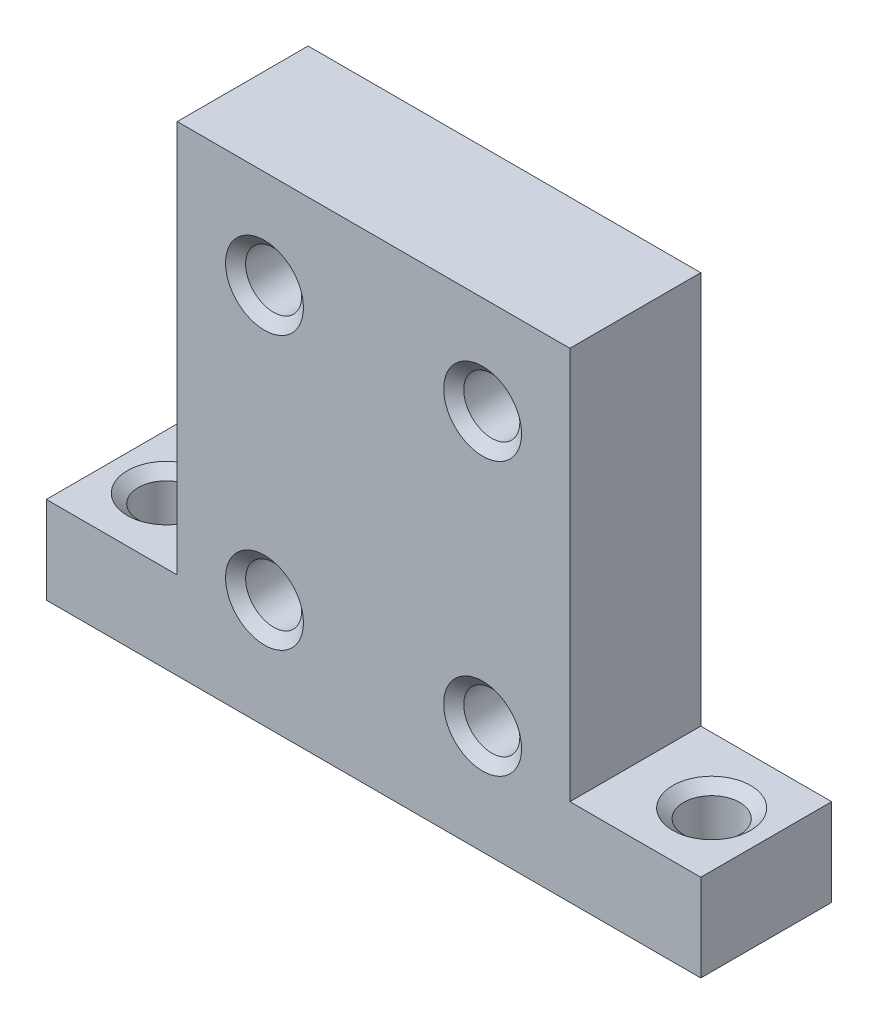
ISO-10303-21;
HEADER;
FILE_DESCRIPTION(('STEP AP214'),'2;1');
FILE_NAME('part.step','',(''),(''),'','','');
FILE_SCHEMA(('AUTOMOTIVE_DESIGN { 1 0 10303 214 1 1 1 1 }'));
ENDSEC;
DATA;
#1=APPLICATION_CONTEXT('core data for automotive mechanical design processes');
#2=APPLICATION_PROTOCOL_DEFINITION('international standard','automotive_design',2000,#1);
#3=PRODUCT_CONTEXT('',#1,'mechanical');
#4=PRODUCT('Part','Part','',(#3));
#5=PRODUCT_RELATED_PRODUCT_CATEGORY('part','',(#4));
#6=PRODUCT_DEFINITION_FORMATION('','',#4);
#7=PRODUCT_DEFINITION_CONTEXT('part definition',#1,'design');
#8=PRODUCT_DEFINITION('design','',#6,#7);
#9=PRODUCT_DEFINITION_SHAPE('','',#8);
#10=(LENGTH_UNIT() NAMED_UNIT(*) SI_UNIT(.MILLI.,.METRE.));
#11=(NAMED_UNIT(*) PLANE_ANGLE_UNIT() SI_UNIT($,.RADIAN.));
#12=(NAMED_UNIT(*) SI_UNIT($,.STERADIAN.) SOLID_ANGLE_UNIT());
#13=UNCERTAINTY_MEASURE_WITH_UNIT(LENGTH_MEASURE(1.E-05),#10,'distance_accuracy_value','');
#14=(GEOMETRIC_REPRESENTATION_CONTEXT(3) GLOBAL_UNCERTAINTY_ASSIGNED_CONTEXT((#13)) GLOBAL_UNIT_ASSIGNED_CONTEXT((#10,
#11,#12)) REPRESENTATION_CONTEXT('',''));
#15=CARTESIAN_POINT('',(0.,0.,0.));
#16=DIRECTION('',(0.,0.,1.));
#17=DIRECTION('',(1.,0.,0.));
#18=AXIS2_PLACEMENT_3D('',#15,#16,#17);
#19=CARTESIAN_POINT('',(0.,5.08,0.));
#20=DIRECTION('',(0.,1.,0.));
#21=DIRECTION('',(0.,0.,1.));
#22=AXIS2_PLACEMENT_3D('',#19,#20,#21);
#23=PLANE('',#22);
#24=CARTESIAN_POINT('',(-34.925,5.08,-3.80999999999999));
#25=DIRECTION('',(0.,1.,0.));
#26=DIRECTION('',(0.,0.,1.));
#27=AXIS2_PLACEMENT_3D('',#24,#25,#26);
#28=CIRCLE('',#27,2.26695);
#29=CARTESIAN_POINT('',(-34.925,5.08,-1.54305));
#30=VERTEX_POINT('',#29);
#31=EDGE_CURVE('E278',#30,#30,#28,.T.);
#32=ORIENTED_EDGE('',*,*,#31,.F.);
#33=EDGE_LOOP('',(#32));
#34=FACE_BOUND('',#33,.T.);
#35=DIRECTION('',(0.,0.,1.));
#36=VECTOR('',#35,1.);
#37=CARTESIAN_POINT('',(-30.48,5.08,-7.62));
#38=LINE('',#37,#36);
#39=CARTESIAN_POINT('',(-30.48,5.08,-7.62));
#40=VERTEX_POINT('',#39);
#41=CARTESIAN_POINT('',(-30.48,5.08,0.));
#42=VERTEX_POINT('',#41);
#43=EDGE_CURVE('E132',#40,#42,#38,.T.);
#44=ORIENTED_EDGE('',*,*,#43,.F.);
#45=DIRECTION('',(-1.,0.,0.));
#46=VECTOR('',#45,1.);
#47=CARTESIAN_POINT('',(0.,5.08,-7.62));
#48=LINE('',#47,#46);
#49=CARTESIAN_POINT('',(-38.1,5.08,-7.61999999999999));
#50=VERTEX_POINT('',#49);
#51=EDGE_CURVE('E149',#40,#50,#48,.T.);
#52=ORIENTED_EDGE('',*,*,#51,.T.);
#53=DIRECTION('',(0.,0.,1.));
#54=VECTOR('',#53,1.);
#55=CARTESIAN_POINT('',(-38.1,5.08,0.));
#56=LINE('',#55,#54);
#57=CARTESIAN_POINT('',(-38.1,5.08,0.));
#58=VERTEX_POINT('',#57);
#59=EDGE_CURVE('E154',#50,#58,#56,.T.);
#60=ORIENTED_EDGE('',*,*,#59,.T.);
#61=DIRECTION('',(1.,0.,0.));
#62=VECTOR('',#61,1.);
#63=CARTESIAN_POINT('',(0.,5.08,0.));
#64=LINE('',#63,#62);
#65=EDGE_CURVE('E67',#58,#42,#64,.T.);
#66=ORIENTED_EDGE('',*,*,#65,.T.);
#67=EDGE_LOOP('',(#44,#52,#60,#66));
#68=FACE_BOUND('',#67,.T.);
#69=ADVANCED_FACE('F43',(#34,#68),#23,.T.);
#70=CARTESIAN_POINT('',(0.,5.08,0.));
#71=DIRECTION('',(-1.,0.,0.));
#72=DIRECTION('',(0.,0.,1.));
#73=AXIS2_PLACEMENT_3D('',#70,#71,#72);
#74=PLANE('',#73);
#75=DIRECTION('',(0.,0.,-1.));
#76=VECTOR('',#75,1.);
#77=CARTESIAN_POINT('',(0.,0.,0.));
#78=LINE('',#77,#76);
#79=CARTESIAN_POINT('',(0.,0.,0.));
#80=VERTEX_POINT('',#79);
#81=CARTESIAN_POINT('',(0.,0.,-7.62));
#82=VERTEX_POINT('',#81);
#83=EDGE_CURVE('E134',#80,#82,#78,.T.);
#84=ORIENTED_EDGE('',*,*,#83,.T.);
#85=DIRECTION('',(0.,-1.,0.));
#86=VECTOR('',#85,1.);
#87=CARTESIAN_POINT('',(0.,5.08,-7.62));
#88=LINE('',#87,#86);
#89=CARTESIAN_POINT('',(0.,5.08,-7.62));
#90=VERTEX_POINT('',#89);
#91=EDGE_CURVE('E11',#90,#82,#88,.T.);
#92=ORIENTED_EDGE('',*,*,#91,.F.);
#93=DIRECTION('',(0.,0.,-1.));
#94=VECTOR('',#93,1.);
#95=CARTESIAN_POINT('',(0.,5.08,0.));
#96=LINE('',#95,#94);
#97=CARTESIAN_POINT('',(0.,5.08,0.));
#98=VERTEX_POINT('',#97);
#99=EDGE_CURVE('E145',#98,#90,#96,.T.);
#100=ORIENTED_EDGE('',*,*,#99,.F.);
#101=DIRECTION('',(0.,-1.,0.));
#102=VECTOR('',#101,1.);
#103=CARTESIAN_POINT('',(0.,5.08,0.));
#104=LINE('',#103,#102);
#105=EDGE_CURVE('E159',#98,#80,#104,.T.);
#106=ORIENTED_EDGE('',*,*,#105,.T.);
#107=EDGE_LOOP('',(#84,#92,#100,#106));
#108=FACE_BOUND('',#107,.T.);
#109=ADVANCED_FACE('F45',(#108),#74,.F.);
#110=CARTESIAN_POINT('',(0.,5.08,-7.62));
#111=DIRECTION('',(0.,0.,1.));
#112=DIRECTION('',(1.,0.,0.));
#113=AXIS2_PLACEMENT_3D('',#110,#111,#112);
#114=PLANE('',#113);
#115=CARTESIAN_POINT('',(-25.4,6.35,-7.62));
#116=DIRECTION('',(0.,0.,1.));
#117=DIRECTION('',(1.,0.,0.));
#118=AXIS2_PLACEMENT_3D('',#115,#116,#117);
#119=CIRCLE('',#118,1.63195);
#120=CARTESIAN_POINT('',(-23.76805,6.35,-7.62));
#121=VERTEX_POINT('',#120);
#122=EDGE_CURVE('E246',#121,#121,#119,.T.);
#123=ORIENTED_EDGE('',*,*,#122,.T.);
#124=EDGE_LOOP('',(#123));
#125=FACE_BOUND('',#124,.T.);
#126=CARTESIAN_POINT('',(-25.4,22.225,-7.62));
#127=DIRECTION('',(0.,0.,1.));
#128=DIRECTION('',(1.,0.,0.));
#129=AXIS2_PLACEMENT_3D('',#126,#127,#128);
#130=CIRCLE('',#129,1.63195);
#131=CARTESIAN_POINT('',(-23.76805,22.225,-7.62));
#132=VERTEX_POINT('',#131);
#133=EDGE_CURVE('E234',#132,#132,#130,.T.);
#134=ORIENTED_EDGE('',*,*,#133,.T.);
#135=EDGE_LOOP('',(#134));
#136=FACE_BOUND('',#135,.T.);
#137=CARTESIAN_POINT('',(-12.7,22.225,-7.62));
#138=DIRECTION('',(0.,0.,1.));
#139=DIRECTION('',(1.,0.,0.));
#140=AXIS2_PLACEMENT_3D('',#137,#138,#139);
#141=CIRCLE('',#140,1.63195);
#142=CARTESIAN_POINT('',(-11.06805,22.225,-7.62));
#143=VERTEX_POINT('',#142);
#144=EDGE_CURVE('E222',#143,#143,#141,.T.);
#145=ORIENTED_EDGE('',*,*,#144,.T.);
#146=EDGE_LOOP('',(#145));
#147=FACE_BOUND('',#146,.T.);
#148=CARTESIAN_POINT('',(-12.7,6.35,-7.62));
#149=DIRECTION('',(0.,0.,1.));
#150=DIRECTION('',(1.,0.,0.));
#151=AXIS2_PLACEMENT_3D('',#148,#149,#150);
#152=CIRCLE('',#151,1.63195);
#153=CARTESIAN_POINT('',(-11.06805,6.35,-7.62));
#154=VERTEX_POINT('',#153);
#155=EDGE_CURVE('E207',#154,#154,#152,.T.);
#156=ORIENTED_EDGE('',*,*,#155,.T.);
#157=EDGE_LOOP('',(#156));
#158=FACE_BOUND('',#157,.T.);
#159=DIRECTION('',(-1.,0.,0.));
#160=VECTOR('',#159,1.);
#161=CARTESIAN_POINT('',(0.,0.,-7.62));
#162=LINE('',#161,#160);
#163=CARTESIAN_POINT('',(-38.1,0.,-7.61999999999999));
#164=VERTEX_POINT('',#163);
#165=EDGE_CURVE('E139',#82,#164,#162,.T.);
#166=ORIENTED_EDGE('',*,*,#165,.T.);
#167=DIRECTION('',(0.,-1.,0.));
#168=VECTOR('',#167,1.);
#169=CARTESIAN_POINT('',(-38.1,5.08,-7.61999999999999));
#170=LINE('',#169,#168);
#171=EDGE_CURVE('E52',#50,#164,#170,.T.);
#172=ORIENTED_EDGE('',*,*,#171,.F.);
#173=ORIENTED_EDGE('',*,*,#51,.F.);
#174=DIRECTION('',(0.,-1.,0.));
#175=VECTOR('',#174,1.);
#176=CARTESIAN_POINT('',(-30.48,27.94,-7.62));
#177=LINE('',#176,#175);
#178=CARTESIAN_POINT('',(-30.48,27.94,-7.62));
#179=VERTEX_POINT('',#178);
#180=EDGE_CURVE('E196',#179,#40,#177,.T.);
#181=ORIENTED_EDGE('',*,*,#180,.F.);
#182=DIRECTION('',(-1.,0.,0.));
#183=VECTOR('',#182,1.);
#184=CARTESIAN_POINT('',(-30.48,27.94,-7.62));
#185=LINE('',#184,#183);
#186=CARTESIAN_POINT('',(-7.62,27.94,-7.62));
#187=VERTEX_POINT('',#186);
#188=EDGE_CURVE('E125',#187,#179,#185,.T.);
#189=ORIENTED_EDGE('',*,*,#188,.F.);
#190=DIRECTION('',(0.,-1.,0.));
#191=VECTOR('',#190,1.);
#192=CARTESIAN_POINT('',(-7.62,27.94,-7.62));
#193=LINE('',#192,#191);
#194=CARTESIAN_POINT('',(-7.62,5.08,-7.62));
#195=VERTEX_POINT('',#194);
#196=EDGE_CURVE('E141',#187,#195,#193,.T.);
#197=ORIENTED_EDGE('',*,*,#196,.T.);
#198=EDGE_CURVE('E151',#90,#195,#48,.T.);
#199=ORIENTED_EDGE('',*,*,#198,.F.);
#200=ORIENTED_EDGE('',*,*,#91,.T.);
#201=EDGE_LOOP('',(#166,#172,#173,#181,#189,#197,#199,#200));
#202=FACE_BOUND('',#201,.T.);
#203=ADVANCED_FACE('F195',(#125,#136,#147,#158,#202),#114,.F.);
#204=CARTESIAN_POINT('',(-38.1,5.08,0.));
#205=DIRECTION('',(1.,0.,0.));
#206=DIRECTION('',(0.,0.,-1.));
#207=AXIS2_PLACEMENT_3D('',#204,#205,#206);
#208=PLANE('',#207);
#209=DIRECTION('',(0.,0.,1.));
#210=VECTOR('',#209,1.);
#211=CARTESIAN_POINT('',(-38.1,0.,0.));
#212=LINE('',#211,#210);
#213=CARTESIAN_POINT('',(-38.1,0.,0.));
#214=VERTEX_POINT('',#213);
#215=EDGE_CURVE('E163',#164,#214,#212,.T.);
#216=ORIENTED_EDGE('',*,*,#215,.T.);
#217=DIRECTION('',(0.,-1.,0.));
#218=VECTOR('',#217,1.);
#219=CARTESIAN_POINT('',(-38.1,5.08,0.));
#220=LINE('',#219,#218);
#221=EDGE_CURVE('E171',#58,#214,#220,.T.);
#222=ORIENTED_EDGE('',*,*,#221,.F.);
#223=ORIENTED_EDGE('',*,*,#59,.F.);
#224=ORIENTED_EDGE('',*,*,#171,.T.);
#225=EDGE_LOOP('',(#216,#222,#223,#224));
#226=FACE_BOUND('',#225,.T.);
#227=ADVANCED_FACE('F180',(#226),#208,.F.);
#228=CARTESIAN_POINT('',(0.,5.08,0.));
#229=DIRECTION('',(0.,0.,-1.));
#230=DIRECTION('',(-1.,0.,0.));
#231=AXIS2_PLACEMENT_3D('',#228,#229,#230);
#232=PLANE('',#231);
#233=CARTESIAN_POINT('',(-25.4,6.35,0.));
#234=DIRECTION('',(0.,0.,1.));
#235=DIRECTION('',(1.,0.,0.));
#236=AXIS2_PLACEMENT_3D('',#233,#234,#235);
#237=CIRCLE('',#236,2.26695);
#238=CARTESIAN_POINT('',(-23.13305,6.35,0.));
#239=VERTEX_POINT('',#238);
#240=EDGE_CURVE('E254',#239,#239,#237,.T.);
#241=ORIENTED_EDGE('',*,*,#240,.F.);
#242=EDGE_LOOP('',(#241));
#243=FACE_BOUND('',#242,.T.);
#244=CARTESIAN_POINT('',(-25.4,22.225,0.));
#245=DIRECTION('',(0.,0.,1.));
#246=DIRECTION('',(1.,0.,0.));
#247=AXIS2_PLACEMENT_3D('',#244,#245,#246);
#248=CIRCLE('',#247,2.26695);
#249=CARTESIAN_POINT('',(-23.13305,22.225,0.));
#250=VERTEX_POINT('',#249);
#251=EDGE_CURVE('E242',#250,#250,#248,.T.);
#252=ORIENTED_EDGE('',*,*,#251,.F.);
#253=EDGE_LOOP('',(#252));
#254=FACE_BOUND('',#253,.T.);
#255=CARTESIAN_POINT('',(-12.7,22.225,0.));
#256=DIRECTION('',(0.,0.,1.));
#257=DIRECTION('',(1.,0.,0.));
#258=AXIS2_PLACEMENT_3D('',#255,#256,#257);
#259=CIRCLE('',#258,2.26695);
#260=CARTESIAN_POINT('',(-10.43305,22.225,0.));
#261=VERTEX_POINT('',#260);
#262=EDGE_CURVE('E230',#261,#261,#259,.T.);
#263=ORIENTED_EDGE('',*,*,#262,.F.);
#264=EDGE_LOOP('',(#263));
#265=FACE_BOUND('',#264,.T.);
#266=CARTESIAN_POINT('',(-12.7,6.35,0.));
#267=DIRECTION('',(0.,0.,1.));
#268=DIRECTION('',(1.,0.,0.));
#269=AXIS2_PLACEMENT_3D('',#266,#267,#268);
#270=CIRCLE('',#269,2.26695);
#271=CARTESIAN_POINT('',(-10.43305,6.35,0.));
#272=VERTEX_POINT('',#271);
#273=EDGE_CURVE('E218',#272,#272,#270,.T.);
#274=ORIENTED_EDGE('',*,*,#273,.F.);
#275=EDGE_LOOP('',(#274));
#276=FACE_BOUND('',#275,.T.);
#277=DIRECTION('',(1.,0.,0.));
#278=VECTOR('',#277,1.);
#279=CARTESIAN_POINT('',(0.,0.,0.));
#280=LINE('',#279,#278);
#281=EDGE_CURVE('E150',#214,#80,#280,.T.);
#282=ORIENTED_EDGE('',*,*,#281,.T.);
#283=ORIENTED_EDGE('',*,*,#105,.F.);
#284=CARTESIAN_POINT('',(-7.62,5.08,0.));
#285=VERTEX_POINT('',#284);
#286=EDGE_CURVE('E157',#285,#98,#64,.T.);
#287=ORIENTED_EDGE('',*,*,#286,.F.);
#288=DIRECTION('',(0.,-1.,0.));
#289=VECTOR('',#288,1.);
#290=CARTESIAN_POINT('',(-7.62,27.94,0.));
#291=LINE('',#290,#289);
#292=CARTESIAN_POINT('',(-7.62,27.94,0.));
#293=VERTEX_POINT('',#292);
#294=EDGE_CURVE('E115',#293,#285,#291,.T.);
#295=ORIENTED_EDGE('',*,*,#294,.F.);
#296=DIRECTION('',(1.,0.,0.));
#297=VECTOR('',#296,1.);
#298=CARTESIAN_POINT('',(-30.48,27.94,0.));
#299=LINE('',#298,#297);
#300=CARTESIAN_POINT('',(-30.48,27.94,0.));
#301=VERTEX_POINT('',#300);
#302=EDGE_CURVE('E108',#301,#293,#299,.T.);
#303=ORIENTED_EDGE('',*,*,#302,.F.);
#304=DIRECTION('',(0.,-1.,0.));
#305=VECTOR('',#304,1.);
#306=CARTESIAN_POINT('',(-30.48,27.94,0.));
#307=LINE('',#306,#305);
#308=EDGE_CURVE('E112',#301,#42,#307,.T.);
#309=ORIENTED_EDGE('',*,*,#308,.T.);
#310=ORIENTED_EDGE('',*,*,#65,.F.);
#311=ORIENTED_EDGE('',*,*,#221,.T.);
#312=EDGE_LOOP('',(#282,#283,#287,#295,#303,#309,#310,#311));
#313=FACE_BOUND('',#312,.T.);
#314=ADVANCED_FACE('F110',(#243,#254,#265,#276,#313),#232,.F.);
#315=CARTESIAN_POINT('',(-3.175,5.08,-3.81));
#316=DIRECTION('',(0.,1.,0.));
#317=DIRECTION('',(0.,0.,1.));
#318=AXIS2_PLACEMENT_3D('',#315,#316,#317);
#319=CIRCLE('',#318,2.26695);
#320=CARTESIAN_POINT('',(-3.175,5.08,-1.54305));
#321=VERTEX_POINT('',#320);
#322=EDGE_CURVE('E266',#321,#321,#319,.T.);
#323=ORIENTED_EDGE('',*,*,#322,.F.);
#324=EDGE_LOOP('',(#323));
#325=FACE_BOUND('',#324,.T.);
#326=DIRECTION('',(0.,0.,-1.));
#327=VECTOR('',#326,1.);
#328=CARTESIAN_POINT('',(-7.62,5.08,-7.62));
#329=LINE('',#328,#327);
#330=EDGE_CURVE('E59',#285,#195,#329,.T.);
#331=ORIENTED_EDGE('',*,*,#330,.F.);
#332=ORIENTED_EDGE('',*,*,#286,.T.);
#333=ORIENTED_EDGE('',*,*,#99,.T.);
#334=ORIENTED_EDGE('',*,*,#198,.T.);
#335=EDGE_LOOP('',(#331,#332,#333,#334));
#336=FACE_BOUND('',#335,.T.);
#337=ADVANCED_FACE('F192',(#325,#336),#23,.T.);
#338=CARTESIAN_POINT('',(0.,0.,0.));
#339=DIRECTION('',(0.,1.,0.));
#340=DIRECTION('',(0.,0.,1.));
#341=AXIS2_PLACEMENT_3D('',#338,#339,#340);
#342=PLANE('',#341);
#343=CARTESIAN_POINT('',(-34.925,0.,-3.80999999999999));
#344=DIRECTION('',(0.,1.,0.));
#345=DIRECTION('',(0.,0.,1.));
#346=AXIS2_PLACEMENT_3D('',#343,#344,#345);
#347=CIRCLE('',#346,1.63195);
#348=CARTESIAN_POINT('',(-34.925,0.,-2.17804999999999));
#349=VERTEX_POINT('',#348);
#350=EDGE_CURVE('E270',#349,#349,#347,.T.);
#351=ORIENTED_EDGE('',*,*,#350,.T.);
#352=EDGE_LOOP('',(#351));
#353=FACE_BOUND('',#352,.T.);
#354=CARTESIAN_POINT('',(-3.175,0.,-3.81));
#355=DIRECTION('',(0.,1.,0.));
#356=DIRECTION('',(0.,0.,1.));
#357=AXIS2_PLACEMENT_3D('',#354,#355,#356);
#358=CIRCLE('',#357,1.63195);
#359=CARTESIAN_POINT('',(-3.175,0.,-2.17805));
#360=VERTEX_POINT('',#359);
#361=EDGE_CURVE('E258',#360,#360,#358,.T.);
#362=ORIENTED_EDGE('',*,*,#361,.T.);
#363=EDGE_LOOP('',(#362));
#364=FACE_BOUND('',#363,.T.);
#365=ORIENTED_EDGE('',*,*,#83,.F.);
#366=ORIENTED_EDGE('',*,*,#281,.F.);
#367=ORIENTED_EDGE('',*,*,#215,.F.);
#368=ORIENTED_EDGE('',*,*,#165,.F.);
#369=EDGE_LOOP('',(#365,#366,#367,#368));
#370=FACE_BOUND('',#369,.T.);
#371=ADVANCED_FACE('F187',(#353,#364,#370),#342,.F.);
#372=CARTESIAN_POINT('',(-30.48,27.94,-7.62));
#373=DIRECTION('',(1.,0.,0.));
#374=DIRECTION('',(0.,0.,-1.));
#375=AXIS2_PLACEMENT_3D('',#372,#373,#374);
#376=PLANE('',#375);
#377=ORIENTED_EDGE('',*,*,#43,.T.);
#378=ORIENTED_EDGE('',*,*,#308,.F.);
#379=DIRECTION('',(0.,0.,1.));
#380=VECTOR('',#379,1.);
#381=CARTESIAN_POINT('',(-30.48,27.94,-7.62));
#382=LINE('',#381,#380);
#383=EDGE_CURVE('E120',#179,#301,#382,.T.);
#384=ORIENTED_EDGE('',*,*,#383,.F.);
#385=ORIENTED_EDGE('',*,*,#180,.T.);
#386=EDGE_LOOP('',(#377,#378,#384,#385));
#387=FACE_BOUND('',#386,.T.);
#388=ADVANCED_FACE('F131',(#387),#376,.F.);
#389=CARTESIAN_POINT('',(-7.62,27.94,-7.62));
#390=DIRECTION('',(-1.,0.,0.));
#391=DIRECTION('',(0.,0.,1.));
#392=AXIS2_PLACEMENT_3D('',#389,#390,#391);
#393=PLANE('',#392);
#394=ORIENTED_EDGE('',*,*,#330,.T.);
#395=ORIENTED_EDGE('',*,*,#196,.F.);
#396=DIRECTION('',(0.,0.,-1.));
#397=VECTOR('',#396,1.);
#398=CARTESIAN_POINT('',(-7.62,27.94,-7.62));
#399=LINE('',#398,#397);
#400=EDGE_CURVE('E119',#293,#187,#399,.T.);
#401=ORIENTED_EDGE('',*,*,#400,.F.);
#402=ORIENTED_EDGE('',*,*,#294,.T.);
#403=EDGE_LOOP('',(#394,#395,#401,#402));
#404=FACE_BOUND('',#403,.T.);
#405=ADVANCED_FACE('F354',(#404),#393,.F.);
#406=CARTESIAN_POINT('',(0.,27.94,0.));
#407=DIRECTION('',(0.,1.,0.));
#408=DIRECTION('',(0.,0.,1.));
#409=AXIS2_PLACEMENT_3D('',#406,#407,#408);
#410=PLANE('',#409);
#411=ORIENTED_EDGE('',*,*,#383,.T.);
#412=ORIENTED_EDGE('',*,*,#302,.T.);
#413=ORIENTED_EDGE('',*,*,#400,.T.);
#414=ORIENTED_EDGE('',*,*,#188,.T.);
#415=EDGE_LOOP('',(#411,#412,#413,#414));
#416=FACE_BOUND('',#415,.T.);
#417=ADVANCED_FACE('F123',(#416),#410,.T.);
#418=CARTESIAN_POINT('',(-12.7,6.35,0.));
#419=DIRECTION('',(0.,0.,1.));
#420=DIRECTION('',(1.,0.,0.));
#421=AXIS2_PLACEMENT_3D('',#418,#419,#420);
#422=CYLINDRICAL_SURFACE('',#421,1.63195);
#423=ORIENTED_EDGE('',*,*,#155,.F.);
#424=EDGE_LOOP('',(#423));
#425=FACE_BOUND('',#424,.T.);
#426=CARTESIAN_POINT('',(-12.7,6.35,-0.532828265797573));
#427=DIRECTION('',(0.,0.,1.));
#428=DIRECTION('',(1.,0.,0.));
#429=AXIS2_PLACEMENT_3D('',#426,#427,#428);
#430=CIRCLE('',#429,1.63195);
#431=CARTESIAN_POINT('',(-11.06805,6.35,-0.532828265797573));
#432=VERTEX_POINT('',#431);
#433=EDGE_CURVE('E214',#432,#432,#430,.T.);
#434=ORIENTED_EDGE('',*,*,#433,.T.);
#435=EDGE_LOOP('',(#434));
#436=FACE_BOUND('',#435,.T.);
#437=ADVANCED_FACE('F347',(#425,#436),#422,.F.);
#438=CARTESIAN_POINT('',(-12.7,6.35,0.));
#439=DIRECTION('',(0.,0.,1.));
#440=DIRECTION('',(1.,0.,0.));
#441=AXIS2_PLACEMENT_3D('',#438,#439,#440);
#442=CONICAL_SURFACE('',#441,2.26695,0.872664625997164);
#443=ORIENTED_EDGE('',*,*,#433,.F.);
#444=EDGE_LOOP('',(#443));
#445=FACE_BOUND('',#444,.T.);
#446=ORIENTED_EDGE('',*,*,#273,.T.);
#447=EDGE_LOOP('',(#446));
#448=FACE_BOUND('',#447,.T.);
#449=ADVANCED_FACE('F343',(#445,#448),#442,.F.);
#450=CARTESIAN_POINT('',(-12.7,22.225,0.));
#451=DIRECTION('',(0.,0.,1.));
#452=DIRECTION('',(1.,0.,0.));
#453=AXIS2_PLACEMENT_3D('',#450,#451,#452);
#454=CYLINDRICAL_SURFACE('',#453,1.63195);
#455=ORIENTED_EDGE('',*,*,#144,.F.);
#456=EDGE_LOOP('',(#455));
#457=FACE_BOUND('',#456,.T.);
#458=CARTESIAN_POINT('',(-12.7,22.225,-0.532828265797573));
#459=DIRECTION('',(0.,0.,1.));
#460=DIRECTION('',(1.,0.,0.));
#461=AXIS2_PLACEMENT_3D('',#458,#459,#460);
#462=CIRCLE('',#461,1.63195);
#463=CARTESIAN_POINT('',(-11.06805,22.225,-0.532828265797573));
#464=VERTEX_POINT('',#463);
#465=EDGE_CURVE('E226',#464,#464,#462,.T.);
#466=ORIENTED_EDGE('',*,*,#465,.T.);
#467=EDGE_LOOP('',(#466));
#468=FACE_BOUND('',#467,.T.);
#469=ADVANCED_FACE('F339',(#457,#468),#454,.F.);
#470=CARTESIAN_POINT('',(-12.7,22.225,0.));
#471=DIRECTION('',(0.,0.,1.));
#472=DIRECTION('',(1.,0.,0.));
#473=AXIS2_PLACEMENT_3D('',#470,#471,#472);
#474=CONICAL_SURFACE('',#473,2.26695,0.872664625997164);
#475=ORIENTED_EDGE('',*,*,#465,.F.);
#476=EDGE_LOOP('',(#475));
#477=FACE_BOUND('',#476,.T.);
#478=ORIENTED_EDGE('',*,*,#262,.T.);
#479=EDGE_LOOP('',(#478));
#480=FACE_BOUND('',#479,.T.);
#481=ADVANCED_FACE('F335',(#477,#480),#474,.F.);
#482=CARTESIAN_POINT('',(-25.4,22.225,0.));
#483=DIRECTION('',(0.,0.,1.));
#484=DIRECTION('',(1.,0.,0.));
#485=AXIS2_PLACEMENT_3D('',#482,#483,#484);
#486=CYLINDRICAL_SURFACE('',#485,1.63195);
#487=ORIENTED_EDGE('',*,*,#133,.F.);
#488=EDGE_LOOP('',(#487));
#489=FACE_BOUND('',#488,.T.);
#490=CARTESIAN_POINT('',(-25.4,22.225,-0.532828265797573));
#491=DIRECTION('',(0.,0.,1.));
#492=DIRECTION('',(1.,0.,0.));
#493=AXIS2_PLACEMENT_3D('',#490,#491,#492);
#494=CIRCLE('',#493,1.63195);
#495=CARTESIAN_POINT('',(-23.76805,22.225,-0.532828265797573));
#496=VERTEX_POINT('',#495);
#497=EDGE_CURVE('E238',#496,#496,#494,.T.);
#498=ORIENTED_EDGE('',*,*,#497,.T.);
#499=EDGE_LOOP('',(#498));
#500=FACE_BOUND('',#499,.T.);
#501=ADVANCED_FACE('F331',(#489,#500),#486,.F.);
#502=CARTESIAN_POINT('',(-25.4,22.225,0.));
#503=DIRECTION('',(0.,0.,1.));
#504=DIRECTION('',(1.,0.,0.));
#505=AXIS2_PLACEMENT_3D('',#502,#503,#504);
#506=CONICAL_SURFACE('',#505,2.26695,0.872664625997164);
#507=ORIENTED_EDGE('',*,*,#497,.F.);
#508=EDGE_LOOP('',(#507));
#509=FACE_BOUND('',#508,.T.);
#510=ORIENTED_EDGE('',*,*,#251,.T.);
#511=EDGE_LOOP('',(#510));
#512=FACE_BOUND('',#511,.T.);
#513=ADVANCED_FACE('F327',(#509,#512),#506,.F.);
#514=CARTESIAN_POINT('',(-25.4,6.35,0.));
#515=DIRECTION('',(0.,0.,1.));
#516=DIRECTION('',(1.,0.,0.));
#517=AXIS2_PLACEMENT_3D('',#514,#515,#516);
#518=CYLINDRICAL_SURFACE('',#517,1.63195);
#519=ORIENTED_EDGE('',*,*,#122,.F.);
#520=EDGE_LOOP('',(#519));
#521=FACE_BOUND('',#520,.T.);
#522=CARTESIAN_POINT('',(-25.4,6.35,-0.532828265797573));
#523=DIRECTION('',(0.,0.,1.));
#524=DIRECTION('',(1.,0.,0.));
#525=AXIS2_PLACEMENT_3D('',#522,#523,#524);
#526=CIRCLE('',#525,1.63195);
#527=CARTESIAN_POINT('',(-23.76805,6.35,-0.532828265797573));
#528=VERTEX_POINT('',#527);
#529=EDGE_CURVE('E250',#528,#528,#526,.T.);
#530=ORIENTED_EDGE('',*,*,#529,.T.);
#531=EDGE_LOOP('',(#530));
#532=FACE_BOUND('',#531,.T.);
#533=ADVANCED_FACE('F323',(#521,#532),#518,.F.);
#534=CARTESIAN_POINT('',(-25.4,6.35,0.));
#535=DIRECTION('',(0.,0.,1.));
#536=DIRECTION('',(1.,0.,0.));
#537=AXIS2_PLACEMENT_3D('',#534,#535,#536);
#538=CONICAL_SURFACE('',#537,2.26695,0.872664625997164);
#539=ORIENTED_EDGE('',*,*,#529,.F.);
#540=EDGE_LOOP('',(#539));
#541=FACE_BOUND('',#540,.T.);
#542=ORIENTED_EDGE('',*,*,#240,.T.);
#543=EDGE_LOOP('',(#542));
#544=FACE_BOUND('',#543,.T.);
#545=ADVANCED_FACE('F315',(#541,#544),#538,.F.);
#546=CARTESIAN_POINT('',(-3.175,5.08,-3.81));
#547=DIRECTION('',(0.,1.,0.));
#548=DIRECTION('',(0.,0.,1.));
#549=AXIS2_PLACEMENT_3D('',#546,#547,#548);
#550=CYLINDRICAL_SURFACE('',#549,1.63194999999999);
#551=ORIENTED_EDGE('',*,*,#361,.F.);
#552=EDGE_LOOP('',(#551));
#553=FACE_BOUND('',#552,.T.);
#554=CARTESIAN_POINT('',(-3.175,4.54717173420242,-3.81));
#555=DIRECTION('',(0.,1.,0.));
#556=DIRECTION('',(0.,0.,1.));
#557=AXIS2_PLACEMENT_3D('',#554,#555,#556);
#558=CIRCLE('',#557,1.63194999999999);
#559=CARTESIAN_POINT('',(-3.175,4.54717173420242,-2.17805000000001));
#560=VERTEX_POINT('',#559);
#561=EDGE_CURVE('E262',#560,#560,#558,.T.);
#562=ORIENTED_EDGE('',*,*,#561,.T.);
#563=EDGE_LOOP('',(#562));
#564=FACE_BOUND('',#563,.T.);
#565=ADVANCED_FACE('F306',(#553,#564),#550,.F.);
#566=CARTESIAN_POINT('',(-3.175,5.08,-3.81));
#567=DIRECTION('',(0.,1.,0.));
#568=DIRECTION('',(0.,0.,1.));
#569=AXIS2_PLACEMENT_3D('',#566,#567,#568);
#570=CONICAL_SURFACE('',#569,2.26695,0.872664625997168);
#571=ORIENTED_EDGE('',*,*,#561,.F.);
#572=EDGE_LOOP('',(#571));
#573=FACE_BOUND('',#572,.T.);
#574=ORIENTED_EDGE('',*,*,#322,.T.);
#575=EDGE_LOOP('',(#574));
#576=FACE_BOUND('',#575,.T.);
#577=ADVANCED_FACE('F303',(#573,#576),#570,.F.);
#578=CARTESIAN_POINT('',(-34.925,5.08,-3.80999999999999));
#579=DIRECTION('',(0.,1.,0.));
#580=DIRECTION('',(0.,0.,1.));
#581=AXIS2_PLACEMENT_3D('',#578,#579,#580);
#582=CYLINDRICAL_SURFACE('',#581,1.63194999999999);
#583=ORIENTED_EDGE('',*,*,#350,.F.);
#584=EDGE_LOOP('',(#583));
#585=FACE_BOUND('',#584,.T.);
#586=CARTESIAN_POINT('',(-34.925,4.54717173420242,-3.80999999999999));
#587=DIRECTION('',(0.,1.,0.));
#588=DIRECTION('',(0.,0.,1.));
#589=AXIS2_PLACEMENT_3D('',#586,#587,#588);
#590=CIRCLE('',#589,1.63194999999999);
#591=CARTESIAN_POINT('',(-34.925,4.54717173420242,-2.17805000000001));
#592=VERTEX_POINT('',#591);
#593=EDGE_CURVE('E274',#592,#592,#590,.T.);
#594=ORIENTED_EDGE('',*,*,#593,.T.);
#595=EDGE_LOOP('',(#594));
#596=FACE_BOUND('',#595,.T.);
#597=ADVANCED_FACE('F305',(#585,#596),#582,.F.);
#598=CARTESIAN_POINT('',(-34.925,5.08,-3.80999999999999));
#599=DIRECTION('',(0.,1.,0.));
#600=DIRECTION('',(0.,0.,1.));
#601=AXIS2_PLACEMENT_3D('',#598,#599,#600);
#602=CONICAL_SURFACE('',#601,2.26695,0.872664625997167);
#603=ORIENTED_EDGE('',*,*,#593,.F.);
#604=EDGE_LOOP('',(#603));
#605=FACE_BOUND('',#604,.T.);
#606=ORIENTED_EDGE('',*,*,#31,.T.);
#607=EDGE_LOOP('',(#606));
#608=FACE_BOUND('',#607,.T.);
#609=ADVANCED_FACE('F283',(#605,#608),#602,.F.);
#610=CLOSED_SHELL('',(#69,#109,#203,#227,#314,#337,#371,#388,#405,#417,#437,#449,#469,#481,#501,
#513,#533,#545,#565,#577,#597,#609));
#611=MANIFOLD_SOLID_BREP('B2',#610);
#612=ADVANCED_BREP_SHAPE_REPRESENTATION('',(#18,#611),#14);
#613=SHAPE_DEFINITION_REPRESENTATION(#9,#612);
ENDSEC;
END-ISO-10303-21;
